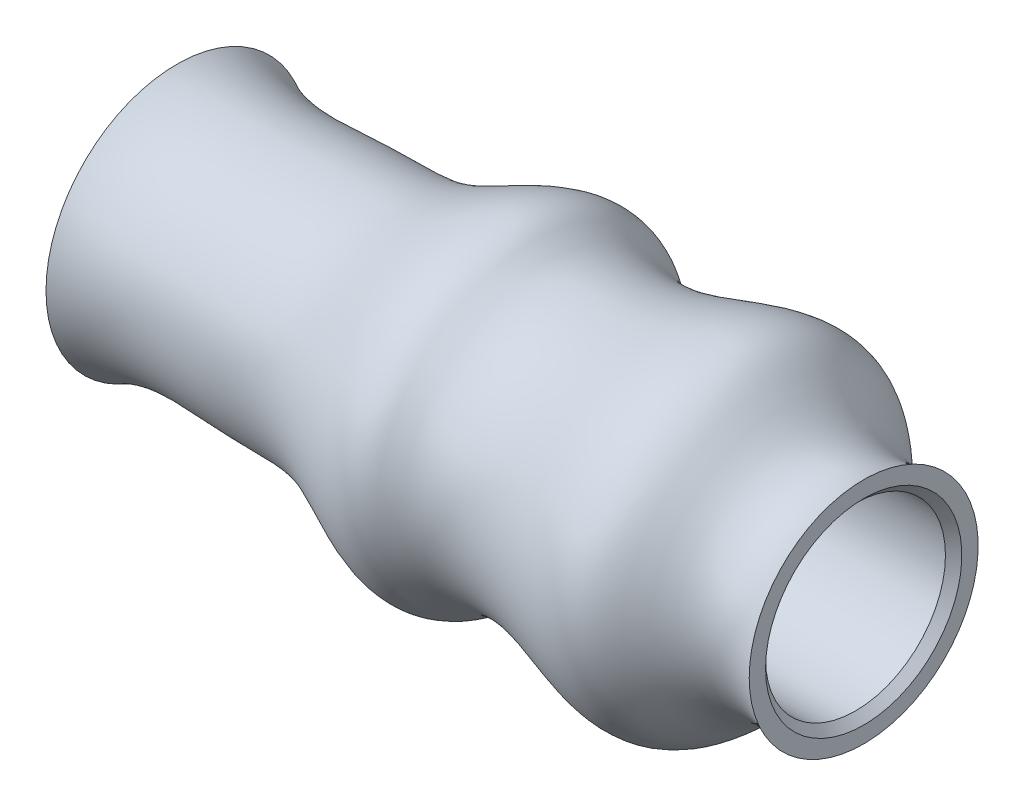
ISO-10303-21;
HEADER;
FILE_DESCRIPTION(('STEP AP214'),'2;1');
FILE_NAME('part.step','',(''),(''),'','','');
FILE_SCHEMA(('AUTOMOTIVE_DESIGN { 1 0 10303 214 1 1 1 1 }'));
ENDSEC;
DATA;
#1=APPLICATION_CONTEXT('core data for automotive mechanical design processes');
#2=APPLICATION_PROTOCOL_DEFINITION('international standard','automotive_design',2000,#1);
#3=PRODUCT_CONTEXT('',#1,'mechanical');
#4=PRODUCT('Part','Part','',(#3));
#5=PRODUCT_RELATED_PRODUCT_CATEGORY('part','',(#4));
#6=PRODUCT_DEFINITION_FORMATION('','',#4);
#7=PRODUCT_DEFINITION_CONTEXT('part definition',#1,'design');
#8=PRODUCT_DEFINITION('design','',#6,#7);
#9=PRODUCT_DEFINITION_SHAPE('','',#8);
#10=(LENGTH_UNIT() NAMED_UNIT(*) SI_UNIT(.MILLI.,.METRE.));
#11=(NAMED_UNIT(*) PLANE_ANGLE_UNIT() SI_UNIT($,.RADIAN.));
#12=(NAMED_UNIT(*) SI_UNIT($,.STERADIAN.) SOLID_ANGLE_UNIT());
#13=UNCERTAINTY_MEASURE_WITH_UNIT(LENGTH_MEASURE(1.E-05),#10,'distance_accuracy_value','');
#14=(GEOMETRIC_REPRESENTATION_CONTEXT(3) GLOBAL_UNCERTAINTY_ASSIGNED_CONTEXT((#13)) GLOBAL_UNIT_ASSIGNED_CONTEXT((#10,
#11,#12)) REPRESENTATION_CONTEXT('',''));
#15=CARTESIAN_POINT('',(0.,0.,0.));
#16=DIRECTION('',(0.,0.,1.));
#17=DIRECTION('',(1.,0.,0.));
#18=AXIS2_PLACEMENT_3D('',#15,#16,#17);
#19=CARTESIAN_POINT('',(42.,7.,0.));
#20=CARTESIAN_POINT('',(38.3378152507803,5.17521672976176,0.));
#21=CARTESIAN_POINT('',(35.8015137508771,11.9082081608677,0.));
#22=CARTESIAN_POINT('',(28.5116723597172,8.53020202522598,0.));
#23=CARTESIAN_POINT('',(23.6284447638172,7.95814012231437,0.));
#24=CARTESIAN_POINT('',(19.7584023282673,11.1638761162749,0.));
#25=CARTESIAN_POINT('',(14.4907189137223,6.91097777301776,0.));
#26=CARTESIAN_POINT('',(7.55411268126978,7.40986973593964,0.));
#27=CARTESIAN_POINT('',(2.71048675106632,6.57130695715822,0.));
#28=CARTESIAN_POINT('',(0.,8.,0.));
#29=B_SPLINE_CURVE_WITH_KNOTS('',3,(#19,#20,#21,#22,#23,#24,#25,#26,#27,#28),.UNSPECIFIED.,.F.,
.F.,(4,1,1,1,1,1,1,4),(0.,0.182870600852405,0.334527467359595,0.462646756821725,
0.496743724631017,0.675497145452513,0.792389791418709,1.),.UNSPECIFIED.);
#30=CARTESIAN_POINT('',(-84.2135211267606,0.,0.));
#31=DIRECTION('',(-1.,0.,0.));
#32=AXIS1_PLACEMENT('',#30,#31);
#33=SURFACE_OF_REVOLUTION('',#29,#32);
#34=CARTESIAN_POINT('',(0.,0.,0.));
#35=DIRECTION('',(-1.,0.,0.));
#36=DIRECTION('',(0.,0.,1.));
#37=AXIS2_PLACEMENT_3D('',#34,#35,#36);
#38=CIRCLE('',#37,8.);
#39=CARTESIAN_POINT('',(0.,0.,8.));
#40=VERTEX_POINT('',#39);
#41=EDGE_CURVE('E60',#40,#40,#38,.T.);
#42=ORIENTED_EDGE('',*,*,#41,.F.);
#43=EDGE_LOOP('',(#42));
#44=FACE_BOUND('',#43,.T.);
#45=CARTESIAN_POINT('',(42.,0.,0.));
#46=DIRECTION('',(-1.,0.,0.));
#47=DIRECTION('',(0.,0.,1.));
#48=AXIS2_PLACEMENT_3D('',#45,#46,#47);
#49=CIRCLE('',#48,7.);
#50=CARTESIAN_POINT('',(42.,0.,7.));
#51=VERTEX_POINT('',#50);
#52=EDGE_CURVE('E42',#51,#51,#49,.T.);
#53=ORIENTED_EDGE('',*,*,#52,.T.);
#54=EDGE_LOOP('',(#53));
#55=FACE_BOUND('',#54,.T.);
#56=ADVANCED_FACE('F31',(#44,#55),#33,.T.);
#57=CARTESIAN_POINT('',(42.,7.,0.));
#58=DIRECTION('',(-1.,0.,0.));
#59=DIRECTION('',(0.,0.,1.));
#60=AXIS2_PLACEMENT_3D('',#57,#58,#59);
#61=PLANE('',#60);
#62=CARTESIAN_POINT('',(42.,0.,0.));
#63=DIRECTION('',(-1.,0.,0.));
#64=DIRECTION('',(0.,0.,1.));
#65=AXIS2_PLACEMENT_3D('',#62,#63,#64);
#66=CIRCLE('',#65,5.99999999999999);
#67=CARTESIAN_POINT('',(42.,0.,5.99999999999999));
#68=VERTEX_POINT('',#67);
#69=EDGE_CURVE('E38',#68,#68,#66,.T.);
#70=ORIENTED_EDGE('',*,*,#69,.T.);
#71=EDGE_LOOP('',(#70));
#72=FACE_BOUND('',#71,.T.);
#73=ORIENTED_EDGE('',*,*,#52,.F.);
#74=EDGE_LOOP('',(#73));
#75=FACE_BOUND('',#74,.T.);
#76=ADVANCED_FACE('F71',(#72,#75),#61,.F.);
#77=CARTESIAN_POINT('',(-84.2135211267606,0.,0.));
#78=DIRECTION('',(-1.,0.,0.));
#79=DIRECTION('',(0.,0.,1.));
#80=AXIS2_PLACEMENT_3D('',#77,#78,#79);
#81=CYLINDRICAL_SURFACE('',#80,5.5);
#82=CARTESIAN_POINT('',(41.5,0.,0.));
#83=DIRECTION('',(-1.,0.,0.));
#84=DIRECTION('',(0.,0.,1.));
#85=AXIS2_PLACEMENT_3D('',#82,#83,#84);
#86=CIRCLE('',#85,5.5);
#87=CARTESIAN_POINT('',(41.5,0.,5.5));
#88=VERTEX_POINT('',#87);
#89=EDGE_CURVE('E10',#88,#88,#86,.F.);
#90=ORIENTED_EDGE('',*,*,#89,.T.);
#91=EDGE_LOOP('',(#90));
#92=FACE_BOUND('',#91,.T.);
#93=CARTESIAN_POINT('',(7.00000000000001,0.,0.));
#94=DIRECTION('',(-1.,0.,0.));
#95=DIRECTION('',(0.,0.,1.));
#96=AXIS2_PLACEMENT_3D('',#93,#94,#95);
#97=CIRCLE('',#96,5.5);
#98=CARTESIAN_POINT('',(7.00000000000001,0.,5.5));
#99=VERTEX_POINT('',#98);
#100=EDGE_CURVE('E46',#99,#99,#97,.T.);
#101=ORIENTED_EDGE('',*,*,#100,.T.);
#102=EDGE_LOOP('',(#101));
#103=FACE_BOUND('',#102,.T.);
#104=ADVANCED_FACE('F75',(#92,#103),#81,.F.);
#105=CARTESIAN_POINT('',(7.,5.5,0.));
#106=DIRECTION('',(-1.,0.,0.));
#107=DIRECTION('',(0.,0.,1.));
#108=AXIS2_PLACEMENT_3D('',#105,#106,#107);
#109=PLANE('',#108);
#110=ORIENTED_EDGE('',*,*,#100,.F.);
#111=EDGE_LOOP('',(#110));
#112=FACE_BOUND('',#111,.T.);
#113=CARTESIAN_POINT('',(6.99999999999999,0.,0.));
#114=DIRECTION('',(-1.,0.,0.));
#115=DIRECTION('',(0.,0.,1.));
#116=AXIS2_PLACEMENT_3D('',#113,#114,#115);
#117=CIRCLE('',#116,2.50000000000001);
#118=CARTESIAN_POINT('',(6.99999999999999,0.,2.50000000000001));
#119=VERTEX_POINT('',#118);
#120=EDGE_CURVE('E51',#119,#119,#117,.T.);
#121=ORIENTED_EDGE('',*,*,#120,.T.);
#122=EDGE_LOOP('',(#121));
#123=FACE_BOUND('',#122,.T.);
#124=ADVANCED_FACE('F78',(#112,#123),#109,.F.);
#125=CARTESIAN_POINT('',(-84.2135211267606,0.,0.));
#126=DIRECTION('',(-1.,0.,0.));
#127=DIRECTION('',(0.,0.,1.));
#128=AXIS2_PLACEMENT_3D('',#125,#126,#127);
#129=CYLINDRICAL_SURFACE('',#128,2.5);
#130=ORIENTED_EDGE('',*,*,#120,.F.);
#131=EDGE_LOOP('',(#130));
#132=FACE_BOUND('',#131,.T.);
#133=CARTESIAN_POINT('',(5.07106781186548,0.,0.));
#134=DIRECTION('',(-1.,0.,0.));
#135=DIRECTION('',(0.,0.,1.));
#136=AXIS2_PLACEMENT_3D('',#133,#134,#135);
#137=CIRCLE('',#136,2.5);
#138=CARTESIAN_POINT('',(5.07106781186548,0.,2.5));
#139=VERTEX_POINT('',#138);
#140=EDGE_CURVE('E54',#139,#139,#137,.T.);
#141=ORIENTED_EDGE('',*,*,#140,.T.);
#142=EDGE_LOOP('',(#141));
#143=FACE_BOUND('',#142,.T.);
#144=ADVANCED_FACE('F81',(#132,#143),#129,.F.);
#145=CARTESIAN_POINT('',(-2.,0.,0.));
#146=DIRECTION('',(-1.,0.,0.));
#147=DIRECTION('',(0.,1.,0.));
#148=AXIS2_PLACEMENT_3D('',#145,#146,#147);
#149=SPHERICAL_SURFACE('',#148,7.5);
#150=ORIENTED_EDGE('',*,*,#140,.F.);
#151=EDGE_LOOP('',(#150));
#152=FACE_BOUND('',#151,.T.);
#153=CARTESIAN_POINT('',(0.,0.,0.));
#154=DIRECTION('',(-1.,0.,0.));
#155=DIRECTION('',(0.,0.,1.));
#156=AXIS2_PLACEMENT_3D('',#153,#154,#155);
#157=CIRCLE('',#156,7.22841614740048);
#158=CARTESIAN_POINT('',(0.,0.,7.22841614740048));
#159=VERTEX_POINT('',#158);
#160=EDGE_CURVE('E57',#159,#159,#157,.T.);
#161=ORIENTED_EDGE('',*,*,#160,.T.);
#162=EDGE_LOOP('',(#161));
#163=FACE_BOUND('',#162,.T.);
#164=ADVANCED_FACE('F85',(#152,#163),#149,.F.);
#165=CARTESIAN_POINT('',(0.,7.22841614740048,0.));
#166=DIRECTION('',(1.,0.,0.));
#167=DIRECTION('',(0.,0.,-1.));
#168=AXIS2_PLACEMENT_3D('',#165,#166,#167);
#169=PLANE('',#168);
#170=ORIENTED_EDGE('',*,*,#160,.F.);
#171=EDGE_LOOP('',(#170));
#172=FACE_BOUND('',#171,.T.);
#173=ORIENTED_EDGE('',*,*,#41,.T.);
#174=EDGE_LOOP('',(#173));
#175=FACE_BOUND('',#174,.T.);
#176=ADVANCED_FACE('F89',(#172,#175),#169,.F.);
#177=CARTESIAN_POINT('',(42.,0.,0.));
#178=DIRECTION('',(1.,0.,0.));
#179=DIRECTION('',(0.,0.,-1.));
#180=AXIS2_PLACEMENT_3D('',#177,#178,#179);
#181=CONICAL_SURFACE('',#180,6.,0.785398163397451);
#182=ORIENTED_EDGE('',*,*,#89,.F.);
#183=EDGE_LOOP('',(#182));
#184=FACE_BOUND('',#183,.T.);
#185=ORIENTED_EDGE('',*,*,#69,.F.);
#186=EDGE_LOOP('',(#185));
#187=FACE_BOUND('',#186,.T.);
#188=ADVANCED_FACE('F33',(#184,#187),#181,.F.);
#189=CLOSED_SHELL('',(#56,#76,#104,#124,#144,#164,#176,#188));
#190=MANIFOLD_SOLID_BREP('B2',#189);
#191=ADVANCED_BREP_SHAPE_REPRESENTATION('',(#18,#190),#14);
#192=SHAPE_DEFINITION_REPRESENTATION(#9,#191);
ENDSEC;
END-ISO-10303-21;
